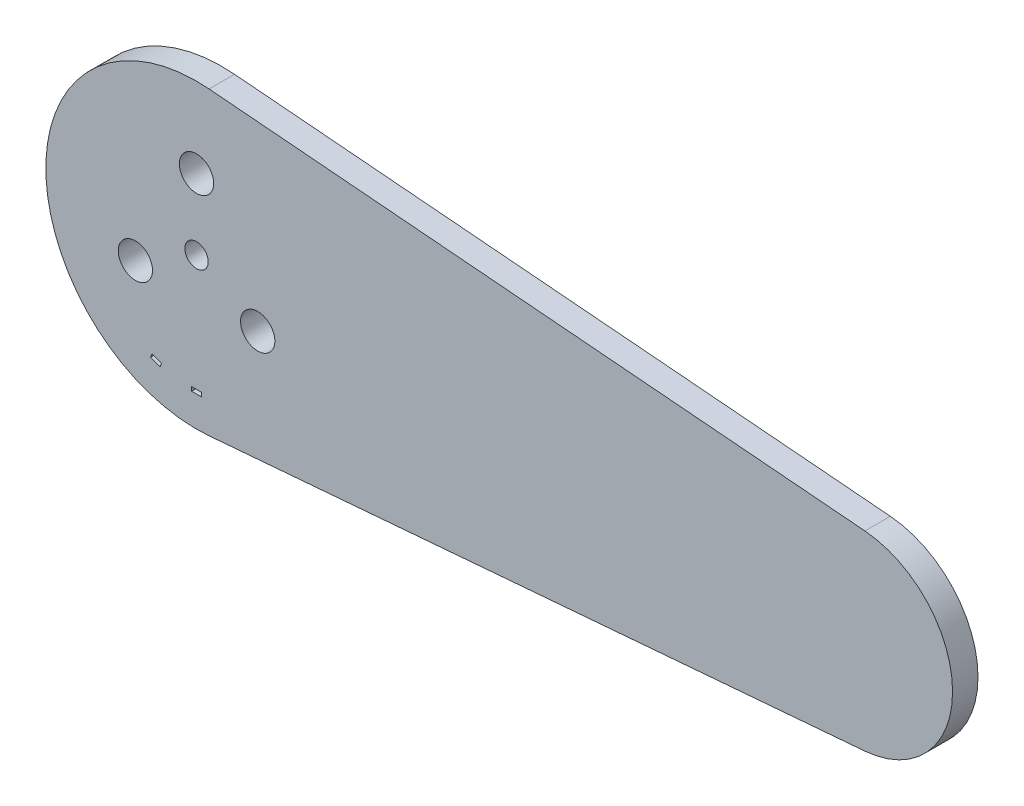
ISO-10303-21;
HEADER;
FILE_DESCRIPTION(('STEP AP214'),'2;1');
FILE_NAME('part.step','',(''),(''),'','','');
FILE_SCHEMA(('AUTOMOTIVE_DESIGN { 1 0 10303 214 1 1 1 1 }'));
ENDSEC;
DATA;
#1=APPLICATION_CONTEXT('core data for automotive mechanical design processes');
#2=APPLICATION_PROTOCOL_DEFINITION('international standard','automotive_design',2000,#1);
#3=PRODUCT_CONTEXT('',#1,'mechanical');
#4=PRODUCT('Part','Part','',(#3));
#5=PRODUCT_RELATED_PRODUCT_CATEGORY('part','',(#4));
#6=PRODUCT_DEFINITION_FORMATION('','',#4);
#7=PRODUCT_DEFINITION_CONTEXT('part definition',#1,'design');
#8=PRODUCT_DEFINITION('design','',#6,#7);
#9=PRODUCT_DEFINITION_SHAPE('','',#8);
#10=(LENGTH_UNIT() NAMED_UNIT(*) SI_UNIT(.MILLI.,.METRE.));
#11=(NAMED_UNIT(*) PLANE_ANGLE_UNIT() SI_UNIT($,.RADIAN.));
#12=(NAMED_UNIT(*) SI_UNIT($,.STERADIAN.) SOLID_ANGLE_UNIT());
#13=UNCERTAINTY_MEASURE_WITH_UNIT(LENGTH_MEASURE(1.E-05),#10,'distance_accuracy_value','');
#14=(GEOMETRIC_REPRESENTATION_CONTEXT(3) GLOBAL_UNCERTAINTY_ASSIGNED_CONTEXT((#13)) GLOBAL_UNIT_ASSIGNED_CONTEXT((#10,
#11,#12)) REPRESENTATION_CONTEXT('',''));
#15=CARTESIAN_POINT('',(0.,0.,0.));
#16=DIRECTION('',(0.,0.,1.));
#17=DIRECTION('',(1.,0.,0.));
#18=AXIS2_PLACEMENT_3D('',#15,#16,#17);
#19=CARTESIAN_POINT('',(0.,0.,3.2004));
#20=DIRECTION('',(0.,0.,1.));
#21=DIRECTION('',(1.,0.,0.));
#22=AXIS2_PLACEMENT_3D('',#19,#20,#21);
#23=PLANE('',#22);
#24=CARTESIAN_POINT('',(7.69896583964423,-4.44499999999967,3.2004));
#25=DIRECTION('',(0.,0.,1.));
#26=DIRECTION('',(1.,0.,0.));
#27=AXIS2_PLACEMENT_3D('',#24,#25,#26);
#28=CIRCLE('',#27,2.15900000000049);
#29=CARTESIAN_POINT('',(9.85796583964472,-4.44499999999967,3.2004));
#30=VERTEX_POINT('',#29);
#31=EDGE_CURVE('E312',#30,#30,#28,.T.);
#32=ORIENTED_EDGE('',*,*,#31,.F.);
#33=EDGE_LOOP('',(#32));
#34=FACE_BOUND('',#33,.T.);
#35=CARTESIAN_POINT('',(0.,8.89,3.2004));
#36=DIRECTION('',(0.,0.,1.));
#37=DIRECTION('',(1.,0.,0.));
#38=AXIS2_PLACEMENT_3D('',#35,#36,#37);
#39=CIRCLE('',#38,2.159);
#40=CARTESIAN_POINT('',(2.159,8.89,3.2004));
#41=VERTEX_POINT('',#40);
#42=EDGE_CURVE('E317',#41,#41,#39,.T.);
#43=ORIENTED_EDGE('',*,*,#42,.F.);
#44=EDGE_LOOP('',(#43));
#45=FACE_BOUND('',#44,.T.);
#46=CARTESIAN_POINT('',(-7.69896583964309,-4.44500000000033,3.2004));
#47=DIRECTION('',(0.,0.,1.));
#48=DIRECTION('',(1.,0.,0.));
#49=AXIS2_PLACEMENT_3D('',#46,#47,#48);
#50=CIRCLE('',#49,2.15900000000072);
#51=CARTESIAN_POINT('',(-5.53996583964237,-4.44500000000033,3.2004));
#52=VERTEX_POINT('',#51);
#53=EDGE_CURVE('E323',#52,#52,#50,.T.);
#54=ORIENTED_EDGE('',*,*,#53,.F.);
#55=EDGE_LOOP('',(#54));
#56=FACE_BOUND('',#55,.T.);
#57=DIRECTION('',(-0.939692620785908,0.34202014332567,0.));
#58=VECTOR('',#57,1.);
#59=CARTESIAN_POINT('',(-4.40913354218231,-13.9706106406094,3.2004));
#60=LINE('',#59,#58);
#61=CARTESIAN_POINT('',(-4.40913354218231,-13.9706106406094,3.2004));
#62=VERTEX_POINT('',#61);
#63=CARTESIAN_POINT('',(-5.60254317058041,-13.5362450585858,3.2004));
#64=VERTEX_POINT('',#63);
#65=EDGE_CURVE('E48',#62,#64,#60,.T.);
#66=ORIENTED_EDGE('',*,*,#65,.F.);
#67=DIRECTION('',(0.342020143325669,0.939692620785908,0.));
#68=VECTOR('',#67,1.);
#69=CARTESIAN_POINT('',(-4.58287977499175,-14.4479744919686,3.2004));
#70=LINE('',#69,#68);
#71=CARTESIAN_POINT('',(-4.58287977499175,-14.4479744919686,3.2004));
#72=VERTEX_POINT('',#71);
#73=EDGE_CURVE('E145',#72,#62,#70,.T.);
#74=ORIENTED_EDGE('',*,*,#73,.F.);
#75=DIRECTION('',(0.939692620785907,-0.342020143325672,0.));
#76=VECTOR('',#75,1.);
#77=CARTESIAN_POINT('',(-5.77628940338985,-14.013608909945,3.2004));
#78=LINE('',#77,#76);
#79=CARTESIAN_POINT('',(-5.77628940338985,-14.013608909945,3.2004));
#80=VERTEX_POINT('',#79);
#81=EDGE_CURVE('E129',#80,#72,#78,.T.);
#82=ORIENTED_EDGE('',*,*,#81,.F.);
#83=DIRECTION('',(-0.34202014332567,-0.939692620785908,0.));
#84=VECTOR('',#83,1.);
#85=CARTESIAN_POINT('',(-5.60254317058041,-13.5362450585858,3.2004));
#86=LINE('',#85,#84);
#87=EDGE_CURVE('E139',#64,#80,#86,.T.);
#88=ORIENTED_EDGE('',*,*,#87,.F.);
#89=EDGE_LOOP('',(#66,#74,#82,#88));
#90=FACE_BOUND('',#89,.T.);
#91=DIRECTION('',(-1.,0.,0.));
#92=VECTOR('',#91,1.);
#93=CARTESIAN_POINT('',(0.634999999999997,-14.6360922128929,3.2004));
#94=LINE('',#93,#92);
#95=CARTESIAN_POINT('',(0.634999999999997,-14.6360922128929,3.2004));
#96=VERTEX_POINT('',#95);
#97=CARTESIAN_POINT('',(-0.635000000000001,-14.6360922128929,3.2004));
#98=VERTEX_POINT('',#97);
#99=EDGE_CURVE('E56',#96,#98,#94,.T.);
#100=ORIENTED_EDGE('',*,*,#99,.F.);
#101=DIRECTION('',(0.,1.,0.));
#102=VECTOR('',#101,1.);
#103=CARTESIAN_POINT('',(0.634999999999998,-15.1440922128929,3.2004));
#104=LINE('',#103,#102);
#105=CARTESIAN_POINT('',(0.634999999999998,-15.1440922128929,3.2004));
#106=VERTEX_POINT('',#105);
#107=EDGE_CURVE('E175',#106,#96,#104,.T.);
#108=ORIENTED_EDGE('',*,*,#107,.F.);
#109=DIRECTION('',(1.,0.,0.));
#110=VECTOR('',#109,1.);
#111=CARTESIAN_POINT('',(-0.635000000000171,-15.1440922128929,3.2004));
#112=LINE('',#111,#110);
#113=CARTESIAN_POINT('',(-0.635000000000171,-15.1440922128929,3.2004));
#114=VERTEX_POINT('',#113);
#115=EDGE_CURVE('E172',#114,#106,#112,.T.);
#116=ORIENTED_EDGE('',*,*,#115,.F.);
#117=DIRECTION('',(-3.34864804848377E-13,-1.,0.));
#118=VECTOR('',#117,1.);
#119=CARTESIAN_POINT('',(-0.635000000000001,-14.6360922128929,3.2004));
#120=LINE('',#119,#118);
#121=EDGE_CURVE('E168',#98,#114,#120,.T.);
#122=ORIENTED_EDGE('',*,*,#121,.F.);
#123=EDGE_LOOP('',(#100,#108,#116,#122));
#124=FACE_BOUND('',#123,.T.);
#125=CARTESIAN_POINT('',(0.,0.,3.2004));
#126=DIRECTION('',(0.,0.,1.));
#127=DIRECTION('',(1.,0.,0.));
#128=AXIS2_PLACEMENT_3D('',#125,#126,#127);
#129=CIRCLE('',#128,18.9738147162461);
#130=CARTESIAN_POINT('',(1.58185229046157,18.90776,3.2004));
#131=VERTEX_POINT('',#130);
#132=CARTESIAN_POINT('',(1.58185229046157,-18.90776,3.2004));
#133=VERTEX_POINT('',#132);
#134=EDGE_CURVE('E192',#131,#133,#129,.T.);
#135=ORIENTED_EDGE('',*,*,#134,.T.);
#136=DIRECTION('',(0.996518638068623,0.0833702823664181,0.));
#137=VECTOR('',#136,1.);
#138=CARTESIAN_POINT('',(1.58185229046157,-18.90776,3.2004));
#139=LINE('',#138,#137);
#140=CARTESIAN_POINT('',(84.1318522904616,-12.0015,3.2004));
#141=VERTEX_POINT('',#140);
#142=EDGE_CURVE('E195',#133,#141,#139,.T.);
#143=ORIENTED_EDGE('',*,*,#142,.T.);
#144=CARTESIAN_POINT('',(83.1277883366154,0.,3.2004));
#145=DIRECTION('',(0.,0.,1.));
#146=DIRECTION('',(-1.,0.,0.));
#147=AXIS2_PLACEMENT_3D('',#144,#145,#146);
#148=CIRCLE('',#147,12.0434275301267);
#149=CARTESIAN_POINT('',(84.1318522904616,12.0015,3.2004));
#150=VERTEX_POINT('',#149);
#151=EDGE_CURVE('E198',#141,#150,#148,.T.);
#152=ORIENTED_EDGE('',*,*,#151,.T.);
#153=DIRECTION('',(-0.996518638068623,0.0833702823664181,0.));
#154=VECTOR('',#153,1.);
#155=CARTESIAN_POINT('',(1.58185229046157,18.90776,3.2004));
#156=LINE('',#155,#154);
#157=EDGE_CURVE('E200',#150,#131,#156,.T.);
#158=ORIENTED_EDGE('',*,*,#157,.T.);
#159=EDGE_LOOP('',(#135,#143,#152,#158));
#160=FACE_BOUND('',#159,.T.);
#161=CARTESIAN_POINT('',(0.,0.,3.2004));
#162=DIRECTION('',(0.,0.,1.));
#163=DIRECTION('',(1.,0.,0.));
#164=AXIS2_PLACEMENT_3D('',#161,#162,#163);
#165=CIRCLE('',#164,1.4732);
#166=CARTESIAN_POINT('',(1.4732,0.,3.2004));
#167=VERTEX_POINT('',#166);
#168=EDGE_CURVE('E186',#167,#167,#165,.T.);
#169=ORIENTED_EDGE('',*,*,#168,.F.);
#170=EDGE_LOOP('',(#169));
#171=FACE_BOUND('',#170,.T.);
#172=ADVANCED_FACE('F33',(#34,#45,#56,#90,#124,#160,#171),#23,.T.);
#173=CARTESIAN_POINT('',(0.,0.,0.));
#174=DIRECTION('',(0.,0.,1.));
#175=DIRECTION('',(1.,0.,0.));
#176=AXIS2_PLACEMENT_3D('',#173,#174,#175);
#177=PLANE('',#176);
#178=CARTESIAN_POINT('',(7.69896583964423,-4.44499999999967,0.));
#179=DIRECTION('',(0.,0.,1.));
#180=DIRECTION('',(1.,0.,0.));
#181=AXIS2_PLACEMENT_3D('',#178,#179,#180);
#182=CIRCLE('',#181,2.15900000000049);
#183=CARTESIAN_POINT('',(9.85796583964472,-4.44499999999967,0.));
#184=VERTEX_POINT('',#183);
#185=EDGE_CURVE('E169',#184,#184,#182,.F.);
#186=ORIENTED_EDGE('',*,*,#185,.F.);
#187=EDGE_LOOP('',(#186));
#188=FACE_BOUND('',#187,.T.);
#189=CARTESIAN_POINT('',(0.,8.89,0.));
#190=DIRECTION('',(0.,0.,1.));
#191=DIRECTION('',(1.,0.,0.));
#192=AXIS2_PLACEMENT_3D('',#189,#190,#191);
#193=CIRCLE('',#192,2.159);
#194=CARTESIAN_POINT('',(2.159,8.89,0.));
#195=VERTEX_POINT('',#194);
#196=EDGE_CURVE('E313',#195,#195,#193,.F.);
#197=ORIENTED_EDGE('',*,*,#196,.F.);
#198=EDGE_LOOP('',(#197));
#199=FACE_BOUND('',#198,.T.);
#200=CARTESIAN_POINT('',(-7.69896583964309,-4.44500000000033,0.));
#201=DIRECTION('',(0.,0.,1.));
#202=DIRECTION('',(1.,0.,0.));
#203=AXIS2_PLACEMENT_3D('',#200,#201,#202);
#204=CIRCLE('',#203,2.15900000000072);
#205=CARTESIAN_POINT('',(-5.53996583964237,-4.44500000000033,0.));
#206=VERTEX_POINT('',#205);
#207=EDGE_CURVE('E321',#206,#206,#204,.F.);
#208=ORIENTED_EDGE('',*,*,#207,.F.);
#209=EDGE_LOOP('',(#208));
#210=FACE_BOUND('',#209,.T.);
#211=DIRECTION('',(-0.342020143325669,-0.939692620785908,0.));
#212=VECTOR('',#211,1.);
#213=CARTESIAN_POINT('',(-4.58287977499175,-14.4479744919686,0.));
#214=LINE('',#213,#212);
#215=CARTESIAN_POINT('',(-4.40913354218231,-13.9706106406094,0.));
#216=VERTEX_POINT('',#215);
#217=CARTESIAN_POINT('',(-4.58287977499175,-14.4479744919686,0.));
#218=VERTEX_POINT('',#217);
#219=EDGE_CURVE('E329',#216,#218,#214,.T.);
#220=ORIENTED_EDGE('',*,*,#219,.F.);
#221=DIRECTION('',(0.939692620785908,-0.34202014332567,0.));
#222=VECTOR('',#221,1.);
#223=CARTESIAN_POINT('',(-4.40913354218231,-13.9706106406094,0.));
#224=LINE('',#223,#222);
#225=CARTESIAN_POINT('',(-5.60254317058041,-13.5362450585858,0.));
#226=VERTEX_POINT('',#225);
#227=EDGE_CURVE('E157',#226,#216,#224,.T.);
#228=ORIENTED_EDGE('',*,*,#227,.F.);
#229=DIRECTION('',(0.34202014332567,0.939692620785908,0.));
#230=VECTOR('',#229,1.);
#231=CARTESIAN_POINT('',(-5.60254317058041,-13.5362450585858,0.));
#232=LINE('',#231,#230);
#233=CARTESIAN_POINT('',(-5.77628940338985,-14.013608909945,0.));
#234=VERTEX_POINT('',#233);
#235=EDGE_CURVE('E154',#234,#226,#232,.T.);
#236=ORIENTED_EDGE('',*,*,#235,.F.);
#237=DIRECTION('',(-0.939692620785907,0.342020143325672,0.));
#238=VECTOR('',#237,1.);
#239=CARTESIAN_POINT('',(-5.77628940338985,-14.013608909945,0.));
#240=LINE('',#239,#238);
#241=EDGE_CURVE('E132',#218,#234,#240,.T.);
#242=ORIENTED_EDGE('',*,*,#241,.F.);
#243=EDGE_LOOP('',(#220,#228,#236,#242));
#244=FACE_BOUND('',#243,.T.);
#245=DIRECTION('',(0.,-1.,0.));
#246=VECTOR('',#245,1.);
#247=CARTESIAN_POINT('',(0.634999999999998,-15.1440922128929,0.));
#248=LINE('',#247,#246);
#249=CARTESIAN_POINT('',(0.634999999999997,-14.6360922128929,0.));
#250=VERTEX_POINT('',#249);
#251=CARTESIAN_POINT('',(0.634999999999998,-15.1440922128929,0.));
#252=VERTEX_POINT('',#251);
#253=EDGE_CURVE('E161',#250,#252,#248,.T.);
#254=ORIENTED_EDGE('',*,*,#253,.F.);
#255=DIRECTION('',(1.,0.,0.));
#256=VECTOR('',#255,1.);
#257=CARTESIAN_POINT('',(0.634999999999997,-14.6360922128929,0.));
#258=LINE('',#257,#256);
#259=CARTESIAN_POINT('',(-0.635000000000001,-14.6360922128929,0.));
#260=VERTEX_POINT('',#259);
#261=EDGE_CURVE('E164',#260,#250,#258,.T.);
#262=ORIENTED_EDGE('',*,*,#261,.F.);
#263=DIRECTION('',(3.34864804848377E-13,1.,0.));
#264=VECTOR('',#263,1.);
#265=CARTESIAN_POINT('',(-0.635000000000001,-14.6360922128929,0.));
#266=LINE('',#265,#264);
#267=CARTESIAN_POINT('',(-0.635000000000171,-15.1440922128929,0.));
#268=VERTEX_POINT('',#267);
#269=EDGE_CURVE('E166',#268,#260,#266,.T.);
#270=ORIENTED_EDGE('',*,*,#269,.F.);
#271=DIRECTION('',(-1.,0.,0.));
#272=VECTOR('',#271,1.);
#273=CARTESIAN_POINT('',(-0.635000000000171,-15.1440922128929,0.));
#274=LINE('',#273,#272);
#275=EDGE_CURVE('E158',#252,#268,#274,.T.);
#276=ORIENTED_EDGE('',*,*,#275,.F.);
#277=EDGE_LOOP('',(#254,#262,#270,#276));
#278=FACE_BOUND('',#277,.T.);
#279=CARTESIAN_POINT('',(0.,0.,0.));
#280=DIRECTION('',(0.,0.,1.));
#281=DIRECTION('',(1.,0.,0.));
#282=AXIS2_PLACEMENT_3D('',#279,#280,#281);
#283=CIRCLE('',#282,18.9738147162461);
#284=CARTESIAN_POINT('',(1.58185229046157,18.90776,0.));
#285=VERTEX_POINT('',#284);
#286=CARTESIAN_POINT('',(1.58185229046157,-18.90776,0.));
#287=VERTEX_POINT('',#286);
#288=EDGE_CURVE('E189',#285,#287,#283,.T.);
#289=ORIENTED_EDGE('',*,*,#288,.F.);
#290=DIRECTION('',(-0.996518638068623,0.0833702823664181,0.));
#291=VECTOR('',#290,1.);
#292=CARTESIAN_POINT('',(1.58185229046157,18.90776,0.));
#293=LINE('',#292,#291);
#294=CARTESIAN_POINT('',(84.1318522904616,12.0015,0.));
#295=VERTEX_POINT('',#294);
#296=EDGE_CURVE('E196',#295,#285,#293,.T.);
#297=ORIENTED_EDGE('',*,*,#296,.F.);
#298=CARTESIAN_POINT('',(83.1277883366154,0.,0.));
#299=DIRECTION('',(0.,0.,1.));
#300=DIRECTION('',(-1.,0.,0.));
#301=AXIS2_PLACEMENT_3D('',#298,#299,#300);
#302=CIRCLE('',#301,12.0434275301267);
#303=CARTESIAN_POINT('',(84.1318522904616,-12.0015,0.));
#304=VERTEX_POINT('',#303);
#305=EDGE_CURVE('E207',#304,#295,#302,.T.);
#306=ORIENTED_EDGE('',*,*,#305,.F.);
#307=DIRECTION('',(0.996518638068623,0.0833702823664181,0.));
#308=VECTOR('',#307,1.);
#309=CARTESIAN_POINT('',(1.58185229046157,-18.90776,0.));
#310=LINE('',#309,#308);
#311=EDGE_CURVE('E205',#287,#304,#310,.T.);
#312=ORIENTED_EDGE('',*,*,#311,.F.);
#313=EDGE_LOOP('',(#289,#297,#306,#312));
#314=FACE_BOUND('',#313,.T.);
#315=CARTESIAN_POINT('',(0.,0.,0.));
#316=DIRECTION('',(0.,0.,1.));
#317=DIRECTION('',(1.,0.,0.));
#318=AXIS2_PLACEMENT_3D('',#315,#316,#317);
#319=CIRCLE('',#318,1.4732);
#320=CARTESIAN_POINT('',(1.4732,0.,0.));
#321=VERTEX_POINT('',#320);
#322=EDGE_CURVE('E156',#321,#321,#319,.T.);
#323=ORIENTED_EDGE('',*,*,#322,.T.);
#324=EDGE_LOOP('',(#323));
#325=FACE_BOUND('',#324,.T.);
#326=ADVANCED_FACE('F225',(#188,#199,#210,#244,#278,#314,#325),#177,.F.);
#327=CARTESIAN_POINT('',(0.,0.,3.2004));
#328=DIRECTION('',(0.,0.,-1.));
#329=DIRECTION('',(-1.,0.,0.));
#330=AXIS2_PLACEMENT_3D('',#327,#328,#329);
#331=CYLINDRICAL_SURFACE('',#330,18.9738147162461);
#332=ORIENTED_EDGE('',*,*,#288,.T.);
#333=DIRECTION('',(0.,0.,-1.));
#334=VECTOR('',#333,1.);
#335=CARTESIAN_POINT('',(1.58185229046157,-18.90776,3.2004));
#336=LINE('',#335,#334);
#337=EDGE_CURVE('E11',#133,#287,#336,.T.);
#338=ORIENTED_EDGE('',*,*,#337,.F.);
#339=ORIENTED_EDGE('',*,*,#134,.F.);
#340=DIRECTION('',(0.,0.,-1.));
#341=VECTOR('',#340,1.);
#342=CARTESIAN_POINT('',(1.58185229046157,18.90776,3.2004));
#343=LINE('',#342,#341);
#344=EDGE_CURVE('E202',#131,#285,#343,.T.);
#345=ORIENTED_EDGE('',*,*,#344,.T.);
#346=EDGE_LOOP('',(#332,#338,#339,#345));
#347=FACE_BOUND('',#346,.T.);
#348=ADVANCED_FACE('F35',(#347),#331,.T.);
#349=CARTESIAN_POINT('',(1.58185229046157,-18.90776,3.2004));
#350=DIRECTION('',(-0.0833702823664181,0.996518638068623,0.));
#351=DIRECTION('',(-0.996518638068623,-0.0833702823664181,0.));
#352=AXIS2_PLACEMENT_3D('',#349,#350,#351);
#353=PLANE('',#352);
#354=ORIENTED_EDGE('',*,*,#311,.T.);
#355=DIRECTION('',(0.,0.,-1.));
#356=VECTOR('',#355,1.);
#357=CARTESIAN_POINT('',(84.1318522904616,-12.0015,3.2004));
#358=LINE('',#357,#356);
#359=EDGE_CURVE('E41',#141,#304,#358,.T.);
#360=ORIENTED_EDGE('',*,*,#359,.F.);
#361=ORIENTED_EDGE('',*,*,#142,.F.);
#362=ORIENTED_EDGE('',*,*,#337,.T.);
#363=EDGE_LOOP('',(#354,#360,#361,#362));
#364=FACE_BOUND('',#363,.T.);
#365=ADVANCED_FACE('F236',(#364),#353,.F.);
#366=CARTESIAN_POINT('',(83.1277883366154,0.,3.2004));
#367=DIRECTION('',(0.,0.,-1.));
#368=DIRECTION('',(-1.,0.,0.));
#369=AXIS2_PLACEMENT_3D('',#366,#367,#368);
#370=CYLINDRICAL_SURFACE('',#369,12.0434275301267);
#371=ORIENTED_EDGE('',*,*,#305,.T.);
#372=DIRECTION('',(0.,0.,-1.));
#373=VECTOR('',#372,1.);
#374=CARTESIAN_POINT('',(84.1318522904616,12.0015,3.2004));
#375=LINE('',#374,#373);
#376=EDGE_CURVE('E212',#150,#295,#375,.T.);
#377=ORIENTED_EDGE('',*,*,#376,.F.);
#378=ORIENTED_EDGE('',*,*,#151,.F.);
#379=ORIENTED_EDGE('',*,*,#359,.T.);
#380=EDGE_LOOP('',(#371,#377,#378,#379));
#381=FACE_BOUND('',#380,.T.);
#382=ADVANCED_FACE('F219',(#381),#370,.T.);
#383=CARTESIAN_POINT('',(1.58185229046157,18.90776,3.2004));
#384=DIRECTION('',(-0.0833702823664181,-0.996518638068623,0.));
#385=DIRECTION('',(0.996518638068623,-0.0833702823664181,0.));
#386=AXIS2_PLACEMENT_3D('',#383,#384,#385);
#387=PLANE('',#386);
#388=ORIENTED_EDGE('',*,*,#296,.T.);
#389=ORIENTED_EDGE('',*,*,#344,.F.);
#390=ORIENTED_EDGE('',*,*,#157,.F.);
#391=ORIENTED_EDGE('',*,*,#376,.T.);
#392=EDGE_LOOP('',(#388,#389,#390,#391));
#393=FACE_BOUND('',#392,.T.);
#394=ADVANCED_FACE('F229',(#393),#387,.F.);
#395=CARTESIAN_POINT('',(0.,0.,3.2004));
#396=DIRECTION('',(0.,0.,-1.));
#397=DIRECTION('',(-1.,0.,0.));
#398=AXIS2_PLACEMENT_3D('',#395,#396,#397);
#399=CYLINDRICAL_SURFACE('',#398,1.4732);
#400=ORIENTED_EDGE('',*,*,#168,.T.);
#401=EDGE_LOOP('',(#400));
#402=FACE_BOUND('',#401,.T.);
#403=ORIENTED_EDGE('',*,*,#322,.F.);
#404=EDGE_LOOP('',(#403));
#405=FACE_BOUND('',#404,.T.);
#406=ADVANCED_FACE('F254',(#402,#405),#399,.F.);
#407=CARTESIAN_POINT('',(0.634999999999997,-14.6360922128929,-1.64327895030964));
#408=DIRECTION('',(0.,1.,0.));
#409=DIRECTION('',(0.,0.,1.));
#410=AXIS2_PLACEMENT_3D('',#407,#408,#409);
#411=PLANE('',#410);
#412=ORIENTED_EDGE('',*,*,#261,.T.);
#413=DIRECTION('',(0.,0.,1.));
#414=VECTOR('',#413,1.);
#415=CARTESIAN_POINT('',(0.634999999999997,-14.6360922128929,-1.64327895030964));
#416=LINE('',#415,#414);
#417=EDGE_CURVE('E162',#250,#96,#416,.T.);
#418=ORIENTED_EDGE('',*,*,#417,.T.);
#419=ORIENTED_EDGE('',*,*,#99,.T.);
#420=DIRECTION('',(0.,0.,1.));
#421=VECTOR('',#420,1.);
#422=CARTESIAN_POINT('',(-0.635000000000001,-14.6360922128929,-1.64327895030964));
#423=LINE('',#422,#421);
#424=EDGE_CURVE('E178',#260,#98,#423,.T.);
#425=ORIENTED_EDGE('',*,*,#424,.F.);
#426=EDGE_LOOP('',(#412,#418,#419,#425));
#427=FACE_BOUND('',#426,.T.);
#428=ADVANCED_FACE('F261',(#427),#411,.F.);
#429=CARTESIAN_POINT('',(0.634999999999998,-15.1440922128929,-1.64327895030964));
#430=DIRECTION('',(1.,0.,0.));
#431=DIRECTION('',(0.,1.,0.));
#432=AXIS2_PLACEMENT_3D('',#429,#430,#431);
#433=PLANE('',#432);
#434=ORIENTED_EDGE('',*,*,#253,.T.);
#435=DIRECTION('',(0.,0.,1.));
#436=VECTOR('',#435,1.);
#437=CARTESIAN_POINT('',(0.634999999999998,-15.1440922128929,-1.64327895030964));
#438=LINE('',#437,#436);
#439=EDGE_CURVE('E180',#252,#106,#438,.T.);
#440=ORIENTED_EDGE('',*,*,#439,.T.);
#441=ORIENTED_EDGE('',*,*,#107,.T.);
#442=ORIENTED_EDGE('',*,*,#417,.F.);
#443=EDGE_LOOP('',(#434,#440,#441,#442));
#444=FACE_BOUND('',#443,.T.);
#445=ADVANCED_FACE('F266',(#444),#433,.F.);
#446=CARTESIAN_POINT('',(-0.635000000000171,-15.1440922128929,-1.64327895030964));
#447=DIRECTION('',(0.,-1.,0.));
#448=DIRECTION('',(1.,0.,0.));
#449=AXIS2_PLACEMENT_3D('',#446,#447,#448);
#450=PLANE('',#449);
#451=ORIENTED_EDGE('',*,*,#275,.T.);
#452=DIRECTION('',(0.,0.,1.));
#453=VECTOR('',#452,1.);
#454=CARTESIAN_POINT('',(-0.635000000000171,-15.1440922128929,-1.64327895030964));
#455=LINE('',#454,#453);
#456=EDGE_CURVE('E182',#268,#114,#455,.T.);
#457=ORIENTED_EDGE('',*,*,#456,.T.);
#458=ORIENTED_EDGE('',*,*,#115,.T.);
#459=ORIENTED_EDGE('',*,*,#439,.F.);
#460=EDGE_LOOP('',(#451,#457,#458,#459));
#461=FACE_BOUND('',#460,.T.);
#462=ADVANCED_FACE('F273',(#461),#450,.F.);
#463=CARTESIAN_POINT('',(-0.635000000000001,-14.6360922128929,-1.64327895030964));
#464=DIRECTION('',(-1.,3.34864804848377E-13,0.));
#465=DIRECTION('',(-3.34864804848377E-13,-1.,0.));
#466=AXIS2_PLACEMENT_3D('',#463,#464,#465);
#467=PLANE('',#466);
#468=ORIENTED_EDGE('',*,*,#269,.T.);
#469=ORIENTED_EDGE('',*,*,#424,.T.);
#470=ORIENTED_EDGE('',*,*,#121,.T.);
#471=ORIENTED_EDGE('',*,*,#456,.F.);
#472=EDGE_LOOP('',(#468,#469,#470,#471));
#473=FACE_BOUND('',#472,.T.);
#474=ADVANCED_FACE('F277',(#473),#467,.F.);
#475=CARTESIAN_POINT('',(-4.40913354218231,-13.9706106406094,-1.64327895030964));
#476=DIRECTION('',(0.34202014332567,0.939692620785908,0.));
#477=DIRECTION('',(-0.939692620785908,0.34202014332567,0.));
#478=AXIS2_PLACEMENT_3D('',#475,#476,#477);
#479=PLANE('',#478);
#480=ORIENTED_EDGE('',*,*,#227,.T.);
#481=DIRECTION('',(0.,0.,1.));
#482=VECTOR('',#481,1.);
#483=CARTESIAN_POINT('',(-4.40913354218231,-13.9706106406094,-1.64327895030964));
#484=LINE('',#483,#482);
#485=EDGE_CURVE('E150',#216,#62,#484,.T.);
#486=ORIENTED_EDGE('',*,*,#485,.T.);
#487=ORIENTED_EDGE('',*,*,#65,.T.);
#488=DIRECTION('',(0.,0.,1.));
#489=VECTOR('',#488,1.);
#490=CARTESIAN_POINT('',(-5.60254317058041,-13.5362450585858,-1.64327895030964));
#491=LINE('',#490,#489);
#492=EDGE_CURVE('E136',#226,#64,#491,.T.);
#493=ORIENTED_EDGE('',*,*,#492,.F.);
#494=EDGE_LOOP('',(#480,#486,#487,#493));
#495=FACE_BOUND('',#494,.T.);
#496=ADVANCED_FACE('F280',(#495),#479,.F.);
#497=CARTESIAN_POINT('',(-4.58287977499175,-14.4479744919686,-1.64327895030964));
#498=DIRECTION('',(0.939692620785908,-0.342020143325669,0.));
#499=DIRECTION('',(0.342020143325669,0.939692620785908,0.));
#500=AXIS2_PLACEMENT_3D('',#497,#498,#499);
#501=PLANE('',#500);
#502=ORIENTED_EDGE('',*,*,#219,.T.);
#503=DIRECTION('',(0.,0.,1.));
#504=VECTOR('',#503,1.);
#505=CARTESIAN_POINT('',(-4.58287977499175,-14.4479744919686,-1.64327895030964));
#506=LINE('',#505,#504);
#507=EDGE_CURVE('E135',#218,#72,#506,.T.);
#508=ORIENTED_EDGE('',*,*,#507,.T.);
#509=ORIENTED_EDGE('',*,*,#73,.T.);
#510=ORIENTED_EDGE('',*,*,#485,.F.);
#511=EDGE_LOOP('',(#502,#508,#509,#510));
#512=FACE_BOUND('',#511,.T.);
#513=ADVANCED_FACE('F287',(#512),#501,.F.);
#514=CARTESIAN_POINT('',(-5.77628940338985,-14.013608909945,-1.64327895030964));
#515=DIRECTION('',(-0.342020143325672,-0.939692620785907,0.));
#516=DIRECTION('',(0.939692620785907,-0.342020143325672,0.));
#517=AXIS2_PLACEMENT_3D('',#514,#515,#516);
#518=PLANE('',#517);
#519=ORIENTED_EDGE('',*,*,#241,.T.);
#520=DIRECTION('',(0.,0.,1.));
#521=VECTOR('',#520,1.);
#522=CARTESIAN_POINT('',(-5.77628940338985,-14.013608909945,-1.64327895030964));
#523=LINE('',#522,#521);
#524=EDGE_CURVE('E124',#234,#80,#523,.T.);
#525=ORIENTED_EDGE('',*,*,#524,.T.);
#526=ORIENTED_EDGE('',*,*,#81,.T.);
#527=ORIENTED_EDGE('',*,*,#507,.F.);
#528=EDGE_LOOP('',(#519,#525,#526,#527));
#529=FACE_BOUND('',#528,.T.);
#530=ADVANCED_FACE('F126',(#529),#518,.F.);
#531=CARTESIAN_POINT('',(-5.60254317058041,-13.5362450585858,-1.64327895030964));
#532=DIRECTION('',(-0.939692620785908,0.34202014332567,0.));
#533=DIRECTION('',(-0.34202014332567,-0.939692620785908,0.));
#534=AXIS2_PLACEMENT_3D('',#531,#532,#533);
#535=PLANE('',#534);
#536=ORIENTED_EDGE('',*,*,#235,.T.);
#537=ORIENTED_EDGE('',*,*,#492,.T.);
#538=ORIENTED_EDGE('',*,*,#87,.T.);
#539=ORIENTED_EDGE('',*,*,#524,.F.);
#540=EDGE_LOOP('',(#536,#537,#538,#539));
#541=FACE_BOUND('',#540,.T.);
#542=ADVANCED_FACE('F140',(#541),#535,.F.);
#543=CARTESIAN_POINT('',(-7.69896583964309,-4.44500000000033,-6.10657416232906));
#544=DIRECTION('',(0.,0.,1.));
#545=DIRECTION('',(1.,0.,0.));
#546=AXIS2_PLACEMENT_3D('',#543,#544,#545);
#547=CYLINDRICAL_SURFACE('',#546,2.15900000000072);
#548=ORIENTED_EDGE('',*,*,#207,.T.);
#549=EDGE_LOOP('',(#548));
#550=FACE_BOUND('',#549,.T.);
#551=ORIENTED_EDGE('',*,*,#53,.T.);
#552=EDGE_LOOP('',(#551));
#553=FACE_BOUND('',#552,.T.);
#554=ADVANCED_FACE('F290',(#550,#553),#547,.F.);
#555=CARTESIAN_POINT('',(0.,8.89,-6.10657416232906));
#556=DIRECTION('',(0.,0.,1.));
#557=DIRECTION('',(1.,0.,0.));
#558=AXIS2_PLACEMENT_3D('',#555,#556,#557);
#559=CYLINDRICAL_SURFACE('',#558,2.159);
#560=ORIENTED_EDGE('',*,*,#196,.T.);
#561=EDGE_LOOP('',(#560));
#562=FACE_BOUND('',#561,.T.);
#563=ORIENTED_EDGE('',*,*,#42,.T.);
#564=EDGE_LOOP('',(#563));
#565=FACE_BOUND('',#564,.T.);
#566=ADVANCED_FACE('F298',(#562,#565),#559,.F.);
#567=CARTESIAN_POINT('',(7.69896583964423,-4.44499999999967,-6.10657416232906));
#568=DIRECTION('',(0.,0.,1.));
#569=DIRECTION('',(1.,0.,0.));
#570=AXIS2_PLACEMENT_3D('',#567,#568,#569);
#571=CYLINDRICAL_SURFACE('',#570,2.15900000000049);
#572=ORIENTED_EDGE('',*,*,#185,.T.);
#573=EDGE_LOOP('',(#572));
#574=FACE_BOUND('',#573,.T.);
#575=ORIENTED_EDGE('',*,*,#31,.T.);
#576=EDGE_LOOP('',(#575));
#577=FACE_BOUND('',#576,.T.);
#578=ADVANCED_FACE('F302',(#574,#577),#571,.F.);
#579=CLOSED_SHELL('',(#172,#326,#348,#365,#382,#394,#406,#428,#445,#462,#474,#496,#513,#530,
#542,#554,#566,#578));
#580=MANIFOLD_SOLID_BREP('B2',#579);
#581=ADVANCED_BREP_SHAPE_REPRESENTATION('',(#18,#580),#14);
#582=SHAPE_DEFINITION_REPRESENTATION(#9,#581);
ENDSEC;
END-ISO-10303-21;
